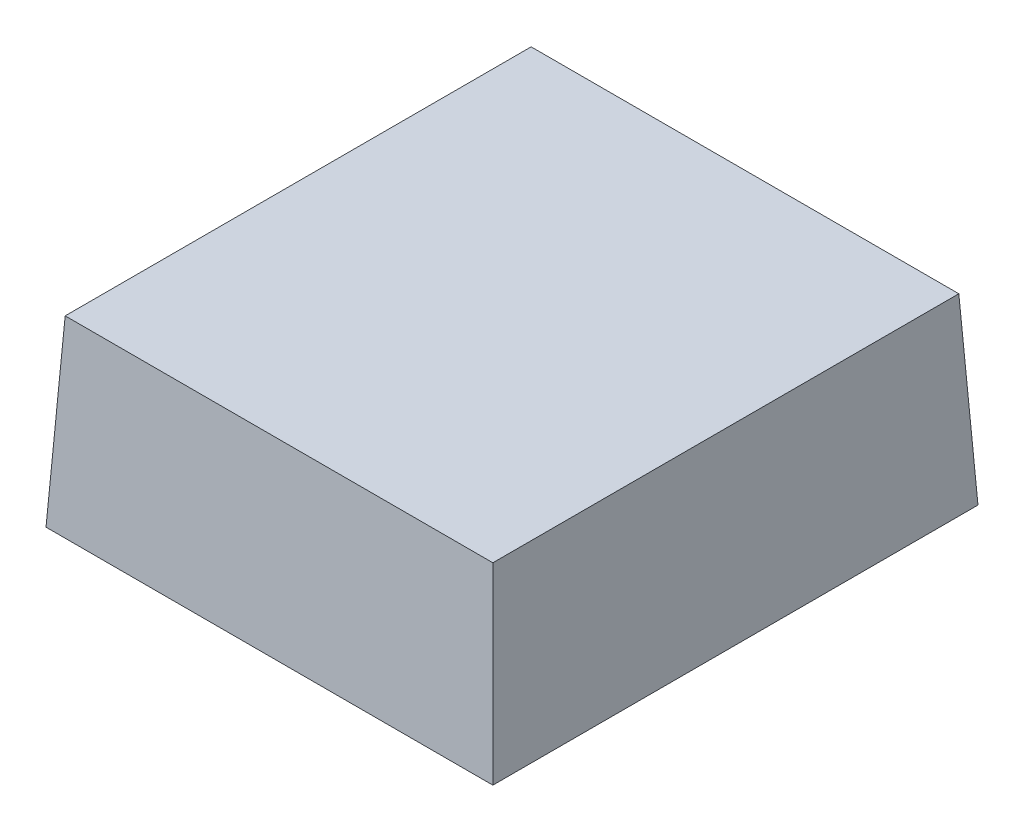
ISO-10303-21;
HEADER;
FILE_DESCRIPTION(('STEP AP214'),'2;1');
FILE_NAME('part.step','',(''),(''),'','','');
FILE_SCHEMA(('AUTOMOTIVE_DESIGN { 1 0 10303 214 1 1 1 1 }'));
ENDSEC;
DATA;
#1=APPLICATION_CONTEXT('core data for automotive mechanical design processes');
#2=APPLICATION_PROTOCOL_DEFINITION('international standard','automotive_design',2000,#1);
#3=PRODUCT_CONTEXT('',#1,'mechanical');
#4=PRODUCT('Part','Part','',(#3));
#5=PRODUCT_RELATED_PRODUCT_CATEGORY('part','',(#4));
#6=PRODUCT_DEFINITION_FORMATION('','',#4);
#7=PRODUCT_DEFINITION_CONTEXT('part definition',#1,'design');
#8=PRODUCT_DEFINITION('design','',#6,#7);
#9=PRODUCT_DEFINITION_SHAPE('','',#8);
#10=(LENGTH_UNIT() NAMED_UNIT(*) SI_UNIT(.MILLI.,.METRE.));
#11=(NAMED_UNIT(*) PLANE_ANGLE_UNIT() SI_UNIT($,.RADIAN.));
#12=(NAMED_UNIT(*) SI_UNIT($,.STERADIAN.) SOLID_ANGLE_UNIT());
#13=UNCERTAINTY_MEASURE_WITH_UNIT(LENGTH_MEASURE(1.E-05),#10,'distance_accuracy_value','');
#14=(GEOMETRIC_REPRESENTATION_CONTEXT(3) GLOBAL_UNCERTAINTY_ASSIGNED_CONTEXT((#13)) GLOBAL_UNIT_ASSIGNED_CONTEXT((#10,
#11,#12)) REPRESENTATION_CONTEXT('',''));
#15=CARTESIAN_POINT('',(0.,0.,0.));
#16=DIRECTION('',(0.,0.,1.));
#17=DIRECTION('',(1.,0.,0.));
#18=AXIS2_PLACEMENT_3D('',#15,#16,#17);
#19=CARTESIAN_POINT('',(0.,0.,0.));
#20=DIRECTION('',(-0.998629534754574,0.0523359562429439,0.));
#21=DIRECTION('',(-0.052335956242944,-0.998629534754574,0.));
#22=AXIS2_PLACEMENT_3D('',#19,#20,#21);
#23=PLANE('',#22);
#24=DIRECTION('',(0.,0.,1.));
#25=VECTOR('',#24,1.);
#26=CARTESIAN_POINT('',(0.,0.,0.));
#27=LINE('',#26,#25);
#28=CARTESIAN_POINT('',(0.,0.,-61.34));
#29=VERTEX_POINT('',#28);
#30=CARTESIAN_POINT('',(0.,0.,0.));
#31=VERTEX_POINT('',#30);
#32=EDGE_CURVE('E84',#29,#31,#27,.T.);
#33=ORIENTED_EDGE('',*,*,#32,.T.);
#34=DIRECTION('',(-0.052264427688714,-0.997264688634237,0.052264427688714));
#35=VECTOR('',#34,1.);
#36=CARTESIAN_POINT('',(0.,0.,0.));
#37=LINE('',#36,#35);
#38=CARTESIAN_POINT('',(1.21271601260958,23.14,-1.21271601260958));
#39=VERTEX_POINT('',#38);
#40=EDGE_CURVE('E11',#39,#31,#37,.T.);
#41=ORIENTED_EDGE('',*,*,#40,.F.);
#42=DIRECTION('',(0.,0.,-1.));
#43=VECTOR('',#42,1.);
#44=CARTESIAN_POINT('',(1.21271601260958,23.14,0.));
#45=LINE('',#44,#43);
#46=CARTESIAN_POINT('',(1.21271601260958,23.14,-60.1272839873904));
#47=VERTEX_POINT('',#46);
#48=EDGE_CURVE('E44',#47,#39,#45,.F.);
#49=ORIENTED_EDGE('',*,*,#48,.F.);
#50=DIRECTION('',(-0.052264427688714,-0.997264688634237,-0.052264427688714));
#51=VECTOR('',#50,1.);
#52=CARTESIAN_POINT('',(0.167554528435912,3.19713085973347,-61.1724454715641));
#53=LINE('',#52,#51);
#54=EDGE_CURVE('E98',#47,#29,#53,.T.);
#55=ORIENTED_EDGE('',*,*,#54,.T.);
#56=EDGE_LOOP('',(#33,#41,#49,#55));
#57=FACE_BOUND('',#56,.T.);
#58=ADVANCED_FACE('F40',(#57),#23,.T.);
#59=CARTESIAN_POINT('',(0.,0.,0.));
#60=DIRECTION('',(0.,0.0523359562429439,0.998629534754574));
#61=DIRECTION('',(0.,-0.998629534754574,0.052335956242944));
#62=AXIS2_PLACEMENT_3D('',#59,#60,#61);
#63=PLANE('',#62);
#64=DIRECTION('',(1.,0.,0.));
#65=VECTOR('',#64,1.);
#66=CARTESIAN_POINT('',(0.,0.,0.));
#67=LINE('',#66,#65);
#68=CARTESIAN_POINT('',(56.5,0.,0.));
#69=VERTEX_POINT('',#68);
#70=EDGE_CURVE('E80',#31,#69,#67,.T.);
#71=ORIENTED_EDGE('',*,*,#70,.T.);
#72=DIRECTION('',(0.052264427688714,-0.997264688634237,0.052264427688714));
#73=VECTOR('',#72,1.);
#74=CARTESIAN_POINT('',(56.5,0.,0.));
#75=LINE('',#74,#73);
#76=CARTESIAN_POINT('',(55.2872839873904,23.14,-1.21271601260958));
#77=VERTEX_POINT('',#76);
#78=EDGE_CURVE('E51',#77,#69,#75,.T.);
#79=ORIENTED_EDGE('',*,*,#78,.F.);
#80=DIRECTION('',(-1.,0.,0.));
#81=VECTOR('',#80,1.);
#82=CARTESIAN_POINT('',(0.,23.14,-1.21271601260958));
#83=LINE('',#82,#81);
#84=EDGE_CURVE('E94',#39,#77,#83,.F.);
#85=ORIENTED_EDGE('',*,*,#84,.F.);
#86=ORIENTED_EDGE('',*,*,#40,.T.);
#87=EDGE_LOOP('',(#71,#79,#85,#86));
#88=FACE_BOUND('',#87,.T.);
#89=ADVANCED_FACE('F93',(#88),#63,.T.);
#90=CARTESIAN_POINT('',(56.5,0.,0.));
#91=DIRECTION('',(0.998629534754574,0.0523359562429439,0.));
#92=DIRECTION('',(-0.052335956242944,0.998629534754574,0.));
#93=AXIS2_PLACEMENT_3D('',#90,#91,#92);
#94=PLANE('',#93);
#95=DIRECTION('',(0.,0.,-1.));
#96=VECTOR('',#95,1.);
#97=CARTESIAN_POINT('',(56.5,0.,0.));
#98=LINE('',#97,#96);
#99=CARTESIAN_POINT('',(56.5,0.,-61.34));
#100=VERTEX_POINT('',#99);
#101=EDGE_CURVE('E85',#69,#100,#98,.T.);
#102=ORIENTED_EDGE('',*,*,#101,.T.);
#103=DIRECTION('',(0.052264427688714,-0.997264688634237,-0.052264427688714));
#104=VECTOR('',#103,1.);
#105=CARTESIAN_POINT('',(56.345666272308,2.94486295361821,-61.185666272308));
#106=LINE('',#105,#104);
#107=CARTESIAN_POINT('',(55.2872839873904,23.14,-60.1272839873904));
#108=VERTEX_POINT('',#107);
#109=EDGE_CURVE('E109',#108,#100,#106,.T.);
#110=ORIENTED_EDGE('',*,*,#109,.F.);
#111=DIRECTION('',(0.,0.,1.));
#112=VECTOR('',#111,1.);
#113=CARTESIAN_POINT('',(55.2872839873904,23.14,0.));
#114=LINE('',#113,#112);
#115=EDGE_CURVE('E117',#77,#108,#114,.F.);
#116=ORIENTED_EDGE('',*,*,#115,.F.);
#117=ORIENTED_EDGE('',*,*,#78,.T.);
#118=EDGE_LOOP('',(#102,#110,#116,#117));
#119=FACE_BOUND('',#118,.T.);
#120=ADVANCED_FACE('F42',(#119),#94,.T.);
#121=CARTESIAN_POINT('',(0.,0.,-61.34));
#122=DIRECTION('',(0.,0.0523359562429439,-0.998629534754574));
#123=DIRECTION('',(0.,0.998629534754574,0.052335956242944));
#124=AXIS2_PLACEMENT_3D('',#121,#122,#123);
#125=PLANE('',#124);
#126=DIRECTION('',(-1.,0.,0.));
#127=VECTOR('',#126,1.);
#128=CARTESIAN_POINT('',(0.,0.,-61.34));
#129=LINE('',#128,#127);
#130=EDGE_CURVE('E106',#100,#29,#129,.T.);
#131=ORIENTED_EDGE('',*,*,#130,.T.);
#132=ORIENTED_EDGE('',*,*,#54,.F.);
#133=DIRECTION('',(1.,0.,0.));
#134=VECTOR('',#133,1.);
#135=CARTESIAN_POINT('',(0.,23.14,-60.1272839873904));
#136=LINE('',#135,#134);
#137=EDGE_CURVE('E59',#108,#47,#136,.F.);
#138=ORIENTED_EDGE('',*,*,#137,.F.);
#139=ORIENTED_EDGE('',*,*,#109,.T.);
#140=EDGE_LOOP('',(#131,#132,#138,#139));
#141=FACE_BOUND('',#140,.T.);
#142=ADVANCED_FACE('F126',(#141),#125,.T.);
#143=CARTESIAN_POINT('',(0.,23.14,0.));
#144=DIRECTION('',(0.,-1.,0.));
#145=DIRECTION('',(0.,0.,-1.));
#146=AXIS2_PLACEMENT_3D('',#143,#144,#145);
#147=PLANE('',#146);
#148=ORIENTED_EDGE('',*,*,#48,.T.);
#149=ORIENTED_EDGE('',*,*,#84,.T.);
#150=ORIENTED_EDGE('',*,*,#115,.T.);
#151=ORIENTED_EDGE('',*,*,#137,.T.);
#152=EDGE_LOOP('',(#148,#149,#150,#151));
#153=FACE_BOUND('',#152,.T.);
#154=ADVANCED_FACE('F121',(#153),#147,.F.);
#155=CARTESIAN_POINT('',(0.,0.,0.));
#156=DIRECTION('',(0.,-1.,0.));
#157=DIRECTION('',(0.,0.,-1.));
#158=AXIS2_PLACEMENT_3D('',#155,#156,#157);
#159=PLANE('',#158);
#160=ORIENTED_EDGE('',*,*,#32,.F.);
#161=ORIENTED_EDGE('',*,*,#130,.F.);
#162=ORIENTED_EDGE('',*,*,#101,.F.);
#163=ORIENTED_EDGE('',*,*,#70,.F.);
#164=EDGE_LOOP('',(#160,#161,#162,#163));
#165=FACE_BOUND('',#164,.T.);
#166=ADVANCED_FACE('F81',(#165),#159,.T.);
#167=CLOSED_SHELL('',(#58,#89,#120,#142,#154,#166));
#168=MANIFOLD_SOLID_BREP('B2',#167);
#169=ADVANCED_BREP_SHAPE_REPRESENTATION('',(#18,#168),#14);
#170=SHAPE_DEFINITION_REPRESENTATION(#9,#169);
ENDSEC;
END-ISO-10303-21;
